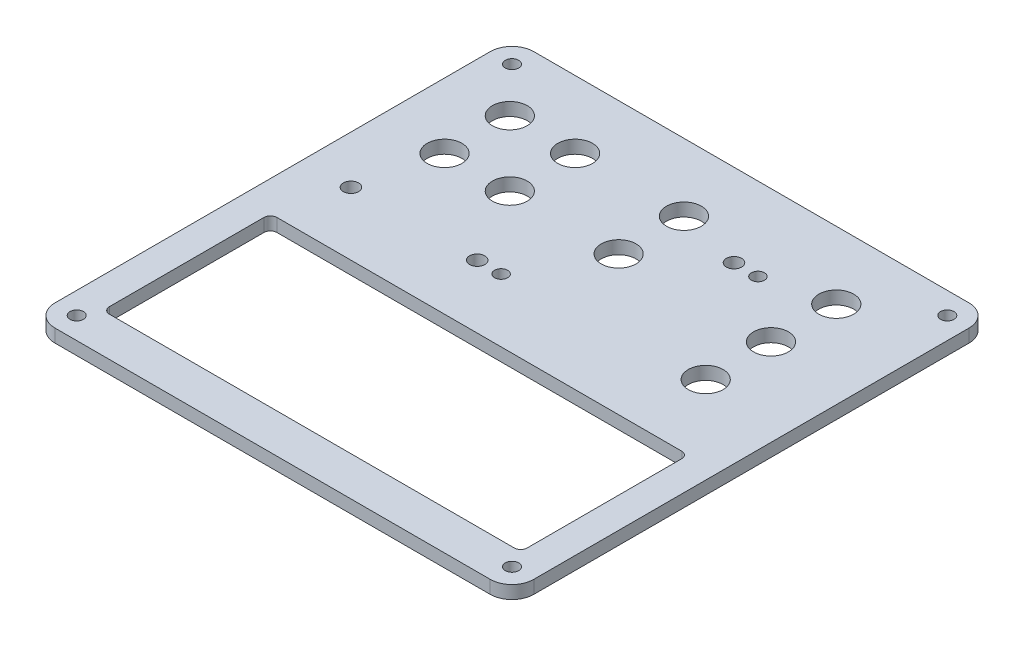
ISO-10303-21;
HEADER;
FILE_DESCRIPTION(('STEP AP214'),'2;1');
FILE_NAME('part.step','',(''),(''),'','','');
FILE_SCHEMA(('AUTOMOTIVE_DESIGN { 1 0 10303 214 1 1 1 1 }'));
ENDSEC;
DATA;
#1=APPLICATION_CONTEXT('core data for automotive mechanical design processes');
#2=APPLICATION_PROTOCOL_DEFINITION('international standard','automotive_design',2000,#1);
#3=PRODUCT_CONTEXT('',#1,'mechanical');
#4=PRODUCT('Part','Part','',(#3));
#5=PRODUCT_RELATED_PRODUCT_CATEGORY('part','',(#4));
#6=PRODUCT_DEFINITION_FORMATION('','',#4);
#7=PRODUCT_DEFINITION_CONTEXT('part definition',#1,'design');
#8=PRODUCT_DEFINITION('design','',#6,#7);
#9=PRODUCT_DEFINITION_SHAPE('','',#8);
#10=(LENGTH_UNIT() NAMED_UNIT(*) SI_UNIT(.MILLI.,.METRE.));
#11=(NAMED_UNIT(*) PLANE_ANGLE_UNIT() SI_UNIT($,.RADIAN.));
#12=(NAMED_UNIT(*) SI_UNIT($,.STERADIAN.) SOLID_ANGLE_UNIT());
#13=UNCERTAINTY_MEASURE_WITH_UNIT(LENGTH_MEASURE(1.E-05),#10,'distance_accuracy_value','');
#14=(GEOMETRIC_REPRESENTATION_CONTEXT(3) GLOBAL_UNCERTAINTY_ASSIGNED_CONTEXT((#13)) GLOBAL_UNIT_ASSIGNED_CONTEXT((#10,
#11,#12)) REPRESENTATION_CONTEXT('',''));
#15=CARTESIAN_POINT('',(0.,0.,0.));
#16=DIRECTION('',(0.,0.,1.));
#17=DIRECTION('',(1.,0.,0.));
#18=AXIS2_PLACEMENT_3D('',#15,#16,#17);
#19=CARTESIAN_POINT('',(0.,3.,0.));
#20=DIRECTION('',(0.,1.,0.));
#21=DIRECTION('',(0.,0.,1.));
#22=AXIS2_PLACEMENT_3D('',#19,#20,#21);
#23=PLANE('',#22);
#24=CARTESIAN_POINT('',(20.5,3.,-36.));
#25=DIRECTION('',(0.,1.,0.));
#26=DIRECTION('',(0.,0.,1.));
#27=AXIS2_PLACEMENT_3D('',#24,#25,#26);
#28=CIRCLE('',#27,1.5);
#29=CARTESIAN_POINT('',(20.5,3.,-34.5));
#30=VERTEX_POINT('',#29);
#31=EDGE_CURVE('E608',#30,#30,#28,.T.);
#32=ORIENTED_EDGE('',*,*,#31,.F.);
#33=EDGE_LOOP('',(#32));
#34=FACE_BOUND('',#33,.T.);
#35=CARTESIAN_POINT('',(15.,3.,-36.));
#36=DIRECTION('',(0.,1.,0.));
#37=DIRECTION('',(0.,0.,1.));
#38=AXIS2_PLACEMENT_3D('',#35,#36,#37);
#39=CIRCLE('',#38,1.75);
#40=CARTESIAN_POINT('',(15.,3.,-34.25));
#41=VERTEX_POINT('',#40);
#42=EDGE_CURVE('E602',#41,#41,#39,.T.);
#43=ORIENTED_EDGE('',*,*,#42,.F.);
#44=EDGE_LOOP('',(#43));
#45=FACE_BOUND('',#44,.T.);
#46=CARTESIAN_POINT('',(-9.50000000000002,3.,-6.99999999999999));
#47=DIRECTION('',(0.,1.,0.));
#48=DIRECTION('',(0.,0.,1.));
#49=AXIS2_PLACEMENT_3D('',#46,#47,#48);
#50=CIRCLE('',#49,1.5);
#51=CARTESIAN_POINT('',(-9.50000000000002,3.,-5.49999999999999));
#52=VERTEX_POINT('',#51);
#53=EDGE_CURVE('E593',#52,#52,#50,.T.);
#54=ORIENTED_EDGE('',*,*,#53,.F.);
#55=EDGE_LOOP('',(#54));
#56=FACE_BOUND('',#55,.T.);
#57=CARTESIAN_POINT('',(-15.,3.,-6.99999999999999));
#58=DIRECTION('',(0.,1.,0.));
#59=DIRECTION('',(0.,0.,1.));
#60=AXIS2_PLACEMENT_3D('',#57,#58,#59);
#61=CIRCLE('',#60,1.75);
#62=CARTESIAN_POINT('',(-15.,3.,-5.24999999999999));
#63=VERTEX_POINT('',#62);
#64=EDGE_CURVE('E579',#63,#63,#61,.T.);
#65=ORIENTED_EDGE('',*,*,#64,.F.);
#66=EDGE_LOOP('',(#65));
#67=FACE_BOUND('',#66,.T.);
#68=CARTESIAN_POINT('',(-44.,3.,-6.99999999999999));
#69=DIRECTION('',(0.,1.,0.));
#70=DIRECTION('',(0.,0.,1.));
#71=AXIS2_PLACEMENT_3D('',#68,#69,#70);
#72=CIRCLE('',#71,1.75);
#73=CARTESIAN_POINT('',(-44.,3.,-5.24999999999999));
#74=VERTEX_POINT('',#73);
#75=EDGE_CURVE('E574',#74,#74,#72,.T.);
#76=ORIENTED_EDGE('',*,*,#75,.F.);
#77=EDGE_LOOP('',(#76));
#78=FACE_BOUND('',#77,.T.);
#79=CARTESIAN_POINT('',(35.,3.,-9.49999999999999));
#80=DIRECTION('',(0.,1.,0.));
#81=DIRECTION('',(0.,0.,1.));
#82=AXIS2_PLACEMENT_3D('',#79,#80,#81);
#83=CIRCLE('',#82,4.00000000000001);
#84=CARTESIAN_POINT('',(35.,3.,-5.49999999999999));
#85=VERTEX_POINT('',#84);
#86=EDGE_CURVE('E568',#85,#85,#83,.T.);
#87=ORIENTED_EDGE('',*,*,#86,.F.);
#88=EDGE_LOOP('',(#87));
#89=FACE_BOUND('',#88,.T.);
#90=CARTESIAN_POINT('',(35.,3.,-24.5));
#91=DIRECTION('',(0.,1.,0.));
#92=DIRECTION('',(0.,0.,1.));
#93=AXIS2_PLACEMENT_3D('',#90,#91,#92);
#94=CIRCLE('',#93,4.00000000000001);
#95=CARTESIAN_POINT('',(35.,3.,-20.5));
#96=VERTEX_POINT('',#95);
#97=EDGE_CURVE('E551',#96,#96,#94,.T.);
#98=ORIENTED_EDGE('',*,*,#97,.F.);
#99=EDGE_LOOP('',(#98));
#100=FACE_BOUND('',#99,.T.);
#101=CARTESIAN_POINT('',(35.,3.,-39.5));
#102=DIRECTION('',(0.,1.,0.));
#103=DIRECTION('',(0.,0.,1.));
#104=AXIS2_PLACEMENT_3D('',#101,#102,#103);
#105=CIRCLE('',#104,4.00000000000001);
#106=CARTESIAN_POINT('',(35.,3.,-35.5));
#107=VERTEX_POINT('',#106);
#108=EDGE_CURVE('E543',#107,#107,#105,.T.);
#109=ORIENTED_EDGE('',*,*,#108,.F.);
#110=EDGE_LOOP('',(#109));
#111=FACE_BOUND('',#110,.T.);
#112=CARTESIAN_POINT('',(-40.,3.,-39.5));
#113=DIRECTION('',(0.,1.,0.));
#114=DIRECTION('',(0.,0.,1.));
#115=AXIS2_PLACEMENT_3D('',#112,#113,#114);
#116=CIRCLE('',#115,4.00000000000001);
#117=CARTESIAN_POINT('',(-40.,3.,-35.5));
#118=VERTEX_POINT('',#117);
#119=EDGE_CURVE('E542',#118,#118,#116,.T.);
#120=ORIENTED_EDGE('',*,*,#119,.F.);
#121=EDGE_LOOP('',(#120));
#122=FACE_BOUND('',#121,.T.);
#123=CARTESIAN_POINT('',(0.,3.,-24.5));
#124=DIRECTION('',(0.,1.,0.));
#125=DIRECTION('',(0.,0.,1.));
#126=AXIS2_PLACEMENT_3D('',#123,#124,#125);
#127=CIRCLE('',#126,4.);
#128=CARTESIAN_POINT('',(0.,3.,-20.5));
#129=VERTEX_POINT('',#128);
#130=EDGE_CURVE('E526',#129,#129,#127,.T.);
#131=ORIENTED_EDGE('',*,*,#130,.F.);
#132=EDGE_LOOP('',(#131));
#133=FACE_BOUND('',#132,.T.);
#134=CARTESIAN_POINT('',(0.,3.,-39.5));
#135=DIRECTION('',(0.,1.,0.));
#136=DIRECTION('',(0.,0.,1.));
#137=AXIS2_PLACEMENT_3D('',#134,#135,#136);
#138=CIRCLE('',#137,4.);
#139=CARTESIAN_POINT('',(0.,3.,-35.5));
#140=VERTEX_POINT('',#139);
#141=EDGE_CURVE('E520',#140,#140,#138,.T.);
#142=ORIENTED_EDGE('',*,*,#141,.F.);
#143=EDGE_LOOP('',(#142));
#144=FACE_BOUND('',#143,.T.);
#145=CARTESIAN_POINT('',(-25.,3.,-24.5));
#146=DIRECTION('',(0.,1.,0.));
#147=DIRECTION('',(0.,0.,1.));
#148=AXIS2_PLACEMENT_3D('',#145,#146,#147);
#149=CIRCLE('',#148,4.);
#150=CARTESIAN_POINT('',(-25.,3.,-20.5));
#151=VERTEX_POINT('',#150);
#152=EDGE_CURVE('E511',#151,#151,#149,.T.);
#153=ORIENTED_EDGE('',*,*,#152,.F.);
#154=EDGE_LOOP('',(#153));
#155=FACE_BOUND('',#154,.T.);
#156=CARTESIAN_POINT('',(-25.,3.,-39.5));
#157=DIRECTION('',(0.,1.,0.));
#158=DIRECTION('',(0.,0.,1.));
#159=AXIS2_PLACEMENT_3D('',#156,#157,#158);
#160=CIRCLE('',#159,4.);
#161=CARTESIAN_POINT('',(-25.,3.,-35.5));
#162=VERTEX_POINT('',#161);
#163=EDGE_CURVE('E497',#162,#162,#160,.T.);
#164=ORIENTED_EDGE('',*,*,#163,.F.);
#165=EDGE_LOOP('',(#164));
#166=FACE_BOUND('',#165,.T.);
#167=CARTESIAN_POINT('',(-40.,3.,-24.5));
#168=DIRECTION('',(0.,1.,0.));
#169=DIRECTION('',(0.,0.,1.));
#170=AXIS2_PLACEMENT_3D('',#167,#168,#169);
#171=CIRCLE('',#170,4.00000000000001);
#172=CARTESIAN_POINT('',(-40.,3.,-20.5));
#173=VERTEX_POINT('',#172);
#174=EDGE_CURVE('E492',#173,#173,#171,.T.);
#175=ORIENTED_EDGE('',*,*,#174,.F.);
#176=EDGE_LOOP('',(#175));
#177=FACE_BOUND('',#176,.T.);
#178=CARTESIAN_POINT('',(-50.,3.,-50.));
#179=DIRECTION('',(0.,1.,0.));
#180=DIRECTION('',(0.,0.,1.));
#181=AXIS2_PLACEMENT_3D('',#178,#179,#180);
#182=CIRCLE('',#181,1.55);
#183=CARTESIAN_POINT('',(-50.,3.,-48.45));
#184=VERTEX_POINT('',#183);
#185=EDGE_CURVE('E475',#184,#184,#182,.T.);
#186=ORIENTED_EDGE('',*,*,#185,.F.);
#187=EDGE_LOOP('',(#186));
#188=FACE_BOUND('',#187,.T.);
#189=CARTESIAN_POINT('',(50.,3.,50.0000000000001));
#190=DIRECTION('',(0.,1.,0.));
#191=DIRECTION('',(0.,0.,1.));
#192=AXIS2_PLACEMENT_3D('',#189,#190,#191);
#193=CIRCLE('',#192,1.55);
#194=CARTESIAN_POINT('',(50.,3.,51.5500000000001));
#195=VERTEX_POINT('',#194);
#196=EDGE_CURVE('E310',#195,#195,#193,.T.);
#197=ORIENTED_EDGE('',*,*,#196,.F.);
#198=EDGE_LOOP('',(#197));
#199=FACE_BOUND('',#198,.T.);
#200=DIRECTION('',(1.,0.,0.));
#201=VECTOR('',#200,1.);
#202=CARTESIAN_POINT('',(-55.,3.,-55.));
#203=LINE('',#202,#201);
#204=CARTESIAN_POINT('',(-50.,3.,-55.));
#205=VERTEX_POINT('',#204);
#206=CARTESIAN_POINT('',(50.,3.,-55.));
#207=VERTEX_POINT('',#206);
#208=EDGE_CURVE('E250',#205,#207,#203,.T.);
#209=ORIENTED_EDGE('',*,*,#208,.F.);
#210=CARTESIAN_POINT('',(-50.,3.,-50.));
#211=DIRECTION('',(0.,1.,0.));
#212=DIRECTION('',(0.,0.,1.));
#213=AXIS2_PLACEMENT_3D('',#210,#211,#212);
#214=CIRCLE('',#213,5.);
#215=CARTESIAN_POINT('',(-55.,3.,-50.));
#216=VERTEX_POINT('',#215);
#217=EDGE_CURVE('E298',#205,#216,#214,.T.);
#218=ORIENTED_EDGE('',*,*,#217,.T.);
#219=DIRECTION('',(0.,0.,1.));
#220=VECTOR('',#219,1.);
#221=CARTESIAN_POINT('',(-55.,3.,-55.));
#222=LINE('',#221,#220);
#223=CARTESIAN_POINT('',(-55.,3.,50.));
#224=VERTEX_POINT('',#223);
#225=EDGE_CURVE('E232',#216,#224,#222,.T.);
#226=ORIENTED_EDGE('',*,*,#225,.T.);
#227=CARTESIAN_POINT('',(-50.,3.,50.));
#228=DIRECTION('',(0.,1.,0.));
#229=DIRECTION('',(0.,0.,1.));
#230=AXIS2_PLACEMENT_3D('',#227,#228,#229);
#231=CIRCLE('',#230,5.);
#232=CARTESIAN_POINT('',(-50.,3.,55.));
#233=VERTEX_POINT('',#232);
#234=EDGE_CURVE('E266',#224,#233,#231,.T.);
#235=ORIENTED_EDGE('',*,*,#234,.T.);
#236=DIRECTION('',(1.,0.,0.));
#237=VECTOR('',#236,1.);
#238=CARTESIAN_POINT('',(-55.,3.,55.));
#239=LINE('',#238,#237);
#240=CARTESIAN_POINT('',(50.,3.,55.));
#241=VERTEX_POINT('',#240);
#242=EDGE_CURVE('E281',#233,#241,#239,.T.);
#243=ORIENTED_EDGE('',*,*,#242,.T.);
#244=CARTESIAN_POINT('',(50.,3.,50.));
#245=DIRECTION('',(0.,1.,0.));
#246=DIRECTION('',(0.,0.,1.));
#247=AXIS2_PLACEMENT_3D('',#244,#245,#246);
#248=CIRCLE('',#247,5.);
#249=CARTESIAN_POINT('',(55.,3.,50.));
#250=VERTEX_POINT('',#249);
#251=EDGE_CURVE('E270',#241,#250,#248,.T.);
#252=ORIENTED_EDGE('',*,*,#251,.T.);
#253=DIRECTION('',(0.,0.,1.));
#254=VECTOR('',#253,1.);
#255=CARTESIAN_POINT('',(55.,3.,-55.));
#256=LINE('',#255,#254);
#257=CARTESIAN_POINT('',(55.,3.,-50.));
#258=VERTEX_POINT('',#257);
#259=EDGE_CURVE('E285',#258,#250,#256,.T.);
#260=ORIENTED_EDGE('',*,*,#259,.F.);
#261=CARTESIAN_POINT('',(50.,3.,-50.));
#262=DIRECTION('',(0.,1.,0.));
#263=DIRECTION('',(0.,0.,1.));
#264=AXIS2_PLACEMENT_3D('',#261,#262,#263);
#265=CIRCLE('',#264,5.);
#266=EDGE_CURVE('E294',#258,#207,#265,.T.);
#267=ORIENTED_EDGE('',*,*,#266,.T.);
#268=EDGE_LOOP('',(#209,#218,#226,#235,#243,#252,#260,#267));
#269=FACE_BOUND('',#268,.T.);
#270=CARTESIAN_POINT('',(-50.,3.,50.));
#271=DIRECTION('',(0.,1.,0.));
#272=DIRECTION('',(0.,0.,1.));
#273=AXIS2_PLACEMENT_3D('',#270,#271,#272);
#274=CIRCLE('',#273,1.55);
#275=CARTESIAN_POINT('',(-50.,3.,51.55));
#276=VERTEX_POINT('',#275);
#277=EDGE_CURVE('E240',#276,#276,#274,.T.);
#278=ORIENTED_EDGE('',*,*,#277,.F.);
#279=EDGE_LOOP('',(#278));
#280=FACE_BOUND('',#279,.T.);
#281=CARTESIAN_POINT('',(50.,3.,-50.));
#282=DIRECTION('',(0.,1.,0.));
#283=DIRECTION('',(0.,0.,1.));
#284=AXIS2_PLACEMENT_3D('',#281,#282,#283);
#285=CIRCLE('',#284,1.55);
#286=CARTESIAN_POINT('',(50.,3.,-48.45));
#287=VERTEX_POINT('',#286);
#288=EDGE_CURVE('E320',#287,#287,#285,.T.);
#289=ORIENTED_EDGE('',*,*,#288,.F.);
#290=EDGE_LOOP('',(#289));
#291=FACE_BOUND('',#290,.T.);
#292=DIRECTION('',(1.,0.,0.));
#293=VECTOR('',#292,1.);
#294=CARTESIAN_POINT('',(-48.,3.,46.));
#295=LINE('',#294,#293);
#296=CARTESIAN_POINT('',(-46.5,3.,46.));
#297=VERTEX_POINT('',#296);
#298=CARTESIAN_POINT('',(46.5,3.,46.));
#299=VERTEX_POINT('',#298);
#300=EDGE_CURVE('E454',#297,#299,#295,.T.);
#301=ORIENTED_EDGE('',*,*,#300,.F.);
#302=CARTESIAN_POINT('',(-46.5,3.,44.5));
#303=DIRECTION('',(0.,1.,0.));
#304=DIRECTION('',(0.,0.,1.));
#305=AXIS2_PLACEMENT_3D('',#302,#303,#304);
#306=CIRCLE('',#305,1.5);
#307=CARTESIAN_POINT('',(-48.,3.,44.5));
#308=VERTEX_POINT('',#307);
#309=EDGE_CURVE('E412',#297,#308,#306,.F.);
#310=ORIENTED_EDGE('',*,*,#309,.T.);
#311=DIRECTION('',(0.,0.,-1.));
#312=VECTOR('',#311,1.);
#313=CARTESIAN_POINT('',(-48.,3.,46.));
#314=LINE('',#313,#312);
#315=CARTESIAN_POINT('',(-48.,3.,9.00000000000001));
#316=VERTEX_POINT('',#315);
#317=EDGE_CURVE('E460',#308,#316,#314,.T.);
#318=ORIENTED_EDGE('',*,*,#317,.T.);
#319=CARTESIAN_POINT('',(-46.5,3.,9.00000000000001));
#320=DIRECTION('',(0.,1.,0.));
#321=DIRECTION('',(0.,0.,1.));
#322=AXIS2_PLACEMENT_3D('',#319,#320,#321);
#323=CIRCLE('',#322,1.5);
#324=CARTESIAN_POINT('',(-46.5,3.,7.50000000000001));
#325=VERTEX_POINT('',#324);
#326=EDGE_CURVE('E106',#316,#325,#323,.F.);
#327=ORIENTED_EDGE('',*,*,#326,.T.);
#328=DIRECTION('',(1.,0.,0.));
#329=VECTOR('',#328,1.);
#330=CARTESIAN_POINT('',(-48.,3.,7.50000000000001));
#331=LINE('',#330,#329);
#332=CARTESIAN_POINT('',(46.5,3.,7.50000000000001));
#333=VERTEX_POINT('',#332);
#334=EDGE_CURVE('E462',#325,#333,#331,.T.);
#335=ORIENTED_EDGE('',*,*,#334,.T.);
#336=CARTESIAN_POINT('',(46.5,3.,9.00000000000001));
#337=DIRECTION('',(0.,1.,0.));
#338=DIRECTION('',(0.,0.,1.));
#339=AXIS2_PLACEMENT_3D('',#336,#337,#338);
#340=CIRCLE('',#339,1.5);
#341=CARTESIAN_POINT('',(48.,3.,9.00000000000001));
#342=VERTEX_POINT('',#341);
#343=EDGE_CURVE('E399',#333,#342,#340,.F.);
#344=ORIENTED_EDGE('',*,*,#343,.T.);
#345=DIRECTION('',(0.,0.,-1.));
#346=VECTOR('',#345,1.);
#347=CARTESIAN_POINT('',(48.,3.,46.));
#348=LINE('',#347,#346);
#349=CARTESIAN_POINT('',(48.,3.,44.5));
#350=VERTEX_POINT('',#349);
#351=EDGE_CURVE('E457',#350,#342,#348,.T.);
#352=ORIENTED_EDGE('',*,*,#351,.F.);
#353=CARTESIAN_POINT('',(46.5,3.,44.5));
#354=DIRECTION('',(0.,1.,0.));
#355=DIRECTION('',(0.,0.,1.));
#356=AXIS2_PLACEMENT_3D('',#353,#354,#355);
#357=CIRCLE('',#356,1.5);
#358=EDGE_CURVE('E407',#350,#299,#357,.F.);
#359=ORIENTED_EDGE('',*,*,#358,.T.);
#360=EDGE_LOOP('',(#301,#310,#318,#327,#335,#344,#352,#359));
#361=FACE_BOUND('',#360,.T.);
#362=ADVANCED_FACE('F98',(#34,#45,#56,#67,#78,#89,#100,#111,#122,#133,#144,#155,#166,#177,#188,
#199,#269,#280,#291,#361),#23,.T.);
#363=CARTESIAN_POINT('',(0.,0.,0.));
#364=DIRECTION('',(0.,1.,0.));
#365=DIRECTION('',(0.,0.,1.));
#366=AXIS2_PLACEMENT_3D('',#363,#364,#365);
#367=PLANE('',#366);
#368=CARTESIAN_POINT('',(20.5,0.,-36.));
#369=DIRECTION('',(0.,1.,0.));
#370=DIRECTION('',(0.,0.,1.));
#371=AXIS2_PLACEMENT_3D('',#368,#369,#370);
#372=CIRCLE('',#371,1.5);
#373=CARTESIAN_POINT('',(20.5,0.,-34.5));
#374=VERTEX_POINT('',#373);
#375=EDGE_CURVE('E612',#374,#374,#372,.T.);
#376=ORIENTED_EDGE('',*,*,#375,.T.);
#377=EDGE_LOOP('',(#376));
#378=FACE_BOUND('',#377,.T.);
#379=CARTESIAN_POINT('',(15.,0.,-36.));
#380=DIRECTION('',(0.,1.,0.));
#381=DIRECTION('',(0.,0.,1.));
#382=AXIS2_PLACEMENT_3D('',#379,#380,#381);
#383=CIRCLE('',#382,1.75);
#384=CARTESIAN_POINT('',(15.,0.,-34.25));
#385=VERTEX_POINT('',#384);
#386=EDGE_CURVE('E605',#385,#385,#383,.T.);
#387=ORIENTED_EDGE('',*,*,#386,.T.);
#388=EDGE_LOOP('',(#387));
#389=FACE_BOUND('',#388,.T.);
#390=CARTESIAN_POINT('',(-9.50000000000002,0.,-6.99999999999999));
#391=DIRECTION('',(0.,1.,0.));
#392=DIRECTION('',(0.,0.,1.));
#393=AXIS2_PLACEMENT_3D('',#390,#391,#392);
#394=CIRCLE('',#393,1.5);
#395=CARTESIAN_POINT('',(-9.50000000000002,0.,-5.49999999999999));
#396=VERTEX_POINT('',#395);
#397=EDGE_CURVE('E591',#396,#396,#394,.T.);
#398=ORIENTED_EDGE('',*,*,#397,.T.);
#399=EDGE_LOOP('',(#398));
#400=FACE_BOUND('',#399,.T.);
#401=CARTESIAN_POINT('',(-15.,0.,-6.99999999999999));
#402=DIRECTION('',(0.,1.,0.));
#403=DIRECTION('',(0.,0.,1.));
#404=AXIS2_PLACEMENT_3D('',#401,#402,#403);
#405=CIRCLE('',#404,1.75);
#406=CARTESIAN_POINT('',(-15.,0.,-5.24999999999999));
#407=VERTEX_POINT('',#406);
#408=EDGE_CURVE('E590',#407,#407,#405,.T.);
#409=ORIENTED_EDGE('',*,*,#408,.T.);
#410=EDGE_LOOP('',(#409));
#411=FACE_BOUND('',#410,.T.);
#412=CARTESIAN_POINT('',(-44.,0.,-6.99999999999999));
#413=DIRECTION('',(0.,1.,0.));
#414=DIRECTION('',(0.,0.,1.));
#415=AXIS2_PLACEMENT_3D('',#412,#413,#414);
#416=CIRCLE('',#415,1.75);
#417=CARTESIAN_POINT('',(-44.,0.,-5.24999999999999));
#418=VERTEX_POINT('',#417);
#419=EDGE_CURVE('E569',#418,#418,#416,.T.);
#420=ORIENTED_EDGE('',*,*,#419,.T.);
#421=EDGE_LOOP('',(#420));
#422=FACE_BOUND('',#421,.T.);
#423=CARTESIAN_POINT('',(35.,0.,-9.49999999999999));
#424=DIRECTION('',(0.,1.,0.));
#425=DIRECTION('',(0.,0.,1.));
#426=AXIS2_PLACEMENT_3D('',#423,#424,#425);
#427=CIRCLE('',#426,4.00000000000001);
#428=CARTESIAN_POINT('',(35.,0.,-5.49999999999999));
#429=VERTEX_POINT('',#428);
#430=EDGE_CURVE('E566',#429,#429,#427,.T.);
#431=ORIENTED_EDGE('',*,*,#430,.T.);
#432=EDGE_LOOP('',(#431));
#433=FACE_BOUND('',#432,.T.);
#434=CARTESIAN_POINT('',(35.,0.,-24.5));
#435=DIRECTION('',(0.,1.,0.));
#436=DIRECTION('',(0.,0.,1.));
#437=AXIS2_PLACEMENT_3D('',#434,#435,#436);
#438=CIRCLE('',#437,4.00000000000001);
#439=CARTESIAN_POINT('',(35.,0.,-20.5));
#440=VERTEX_POINT('',#439);
#441=EDGE_CURVE('E556',#440,#440,#438,.T.);
#442=ORIENTED_EDGE('',*,*,#441,.T.);
#443=EDGE_LOOP('',(#442));
#444=FACE_BOUND('',#443,.T.);
#445=CARTESIAN_POINT('',(35.,0.,-39.5));
#446=DIRECTION('',(0.,1.,0.));
#447=DIRECTION('',(0.,0.,1.));
#448=AXIS2_PLACEMENT_3D('',#445,#446,#447);
#449=CIRCLE('',#448,4.00000000000001);
#450=CARTESIAN_POINT('',(35.,0.,-35.5));
#451=VERTEX_POINT('',#450);
#452=EDGE_CURVE('E548',#451,#451,#449,.T.);
#453=ORIENTED_EDGE('',*,*,#452,.T.);
#454=EDGE_LOOP('',(#453));
#455=FACE_BOUND('',#454,.T.);
#456=CARTESIAN_POINT('',(-40.,0.,-39.5));
#457=DIRECTION('',(0.,1.,0.));
#458=DIRECTION('',(0.,0.,1.));
#459=AXIS2_PLACEMENT_3D('',#456,#457,#458);
#460=CIRCLE('',#459,4.00000000000001);
#461=CARTESIAN_POINT('',(-40.,0.,-35.5));
#462=VERTEX_POINT('',#461);
#463=EDGE_CURVE('E540',#462,#462,#460,.T.);
#464=ORIENTED_EDGE('',*,*,#463,.T.);
#465=EDGE_LOOP('',(#464));
#466=FACE_BOUND('',#465,.T.);
#467=CARTESIAN_POINT('',(0.,0.,-24.5));
#468=DIRECTION('',(0.,1.,0.));
#469=DIRECTION('',(0.,0.,1.));
#470=AXIS2_PLACEMENT_3D('',#467,#468,#469);
#471=CIRCLE('',#470,4.);
#472=CARTESIAN_POINT('',(0.,0.,-20.5));
#473=VERTEX_POINT('',#472);
#474=EDGE_CURVE('E530',#473,#473,#471,.T.);
#475=ORIENTED_EDGE('',*,*,#474,.T.);
#476=EDGE_LOOP('',(#475));
#477=FACE_BOUND('',#476,.T.);
#478=CARTESIAN_POINT('',(0.,0.,-39.5));
#479=DIRECTION('',(0.,1.,0.));
#480=DIRECTION('',(0.,0.,1.));
#481=AXIS2_PLACEMENT_3D('',#478,#479,#480);
#482=CIRCLE('',#481,4.);
#483=CARTESIAN_POINT('',(0.,0.,-35.5));
#484=VERTEX_POINT('',#483);
#485=EDGE_CURVE('E523',#484,#484,#482,.T.);
#486=ORIENTED_EDGE('',*,*,#485,.T.);
#487=EDGE_LOOP('',(#486));
#488=FACE_BOUND('',#487,.T.);
#489=CARTESIAN_POINT('',(-25.,0.,-24.5));
#490=DIRECTION('',(0.,1.,0.));
#491=DIRECTION('',(0.,0.,1.));
#492=AXIS2_PLACEMENT_3D('',#489,#490,#491);
#493=CIRCLE('',#492,4.);
#494=CARTESIAN_POINT('',(-25.,0.,-20.5));
#495=VERTEX_POINT('',#494);
#496=EDGE_CURVE('E509',#495,#495,#493,.T.);
#497=ORIENTED_EDGE('',*,*,#496,.T.);
#498=EDGE_LOOP('',(#497));
#499=FACE_BOUND('',#498,.T.);
#500=CARTESIAN_POINT('',(-25.,0.,-39.5));
#501=DIRECTION('',(0.,1.,0.));
#502=DIRECTION('',(0.,0.,1.));
#503=AXIS2_PLACEMENT_3D('',#500,#501,#502);
#504=CIRCLE('',#503,4.);
#505=CARTESIAN_POINT('',(-25.,0.,-35.5));
#506=VERTEX_POINT('',#505);
#507=EDGE_CURVE('E508',#506,#506,#504,.T.);
#508=ORIENTED_EDGE('',*,*,#507,.T.);
#509=EDGE_LOOP('',(#508));
#510=FACE_BOUND('',#509,.T.);
#511=CARTESIAN_POINT('',(-40.,0.,-24.5));
#512=DIRECTION('',(0.,1.,0.));
#513=DIRECTION('',(0.,0.,1.));
#514=AXIS2_PLACEMENT_3D('',#511,#512,#513);
#515=CIRCLE('',#514,4.00000000000001);
#516=CARTESIAN_POINT('',(-40.,0.,-20.5));
#517=VERTEX_POINT('',#516);
#518=EDGE_CURVE('E463',#517,#517,#515,.T.);
#519=ORIENTED_EDGE('',*,*,#518,.T.);
#520=EDGE_LOOP('',(#519));
#521=FACE_BOUND('',#520,.T.);
#522=CARTESIAN_POINT('',(-50.,0.,-50.));
#523=DIRECTION('',(0.,1.,0.));
#524=DIRECTION('',(0.,0.,1.));
#525=AXIS2_PLACEMENT_3D('',#522,#523,#524);
#526=CIRCLE('',#525,1.55);
#527=CARTESIAN_POINT('',(-50.,0.,-48.45));
#528=VERTEX_POINT('',#527);
#529=EDGE_CURVE('E485',#528,#528,#526,.T.);
#530=ORIENTED_EDGE('',*,*,#529,.T.);
#531=EDGE_LOOP('',(#530));
#532=FACE_BOUND('',#531,.T.);
#533=CARTESIAN_POINT('',(50.,0.,50.0000000000001));
#534=DIRECTION('',(0.,1.,0.));
#535=DIRECTION('',(0.,0.,1.));
#536=AXIS2_PLACEMENT_3D('',#533,#534,#535);
#537=CIRCLE('',#536,1.55);
#538=CARTESIAN_POINT('',(50.,0.,51.5500000000001));
#539=VERTEX_POINT('',#538);
#540=EDGE_CURVE('E316',#539,#539,#537,.T.);
#541=ORIENTED_EDGE('',*,*,#540,.T.);
#542=EDGE_LOOP('',(#541));
#543=FACE_BOUND('',#542,.T.);
#544=DIRECTION('',(0.,0.,1.));
#545=VECTOR('',#544,1.);
#546=CARTESIAN_POINT('',(-55.,0.,-55.));
#547=LINE('',#546,#545);
#548=CARTESIAN_POINT('',(-55.,0.,-50.));
#549=VERTEX_POINT('',#548);
#550=CARTESIAN_POINT('',(-55.,0.,50.));
#551=VERTEX_POINT('',#550);
#552=EDGE_CURVE('E229',#549,#551,#547,.T.);
#553=ORIENTED_EDGE('',*,*,#552,.F.);
#554=CARTESIAN_POINT('',(-50.,0.,-50.));
#555=DIRECTION('',(0.,1.,0.));
#556=DIRECTION('',(0.,0.,1.));
#557=AXIS2_PLACEMENT_3D('',#554,#555,#556);
#558=CIRCLE('',#557,5.);
#559=CARTESIAN_POINT('',(-50.,0.,-55.));
#560=VERTEX_POINT('',#559);
#561=EDGE_CURVE('E212',#549,#560,#558,.F.);
#562=ORIENTED_EDGE('',*,*,#561,.T.);
#563=DIRECTION('',(1.,0.,0.));
#564=VECTOR('',#563,1.);
#565=CARTESIAN_POINT('',(-55.,0.,-55.));
#566=LINE('',#565,#564);
#567=CARTESIAN_POINT('',(50.,0.,-55.));
#568=VERTEX_POINT('',#567);
#569=EDGE_CURVE('E256',#560,#568,#566,.T.);
#570=ORIENTED_EDGE('',*,*,#569,.T.);
#571=CARTESIAN_POINT('',(50.,0.,-50.));
#572=DIRECTION('',(0.,1.,0.));
#573=DIRECTION('',(0.,0.,1.));
#574=AXIS2_PLACEMENT_3D('',#571,#572,#573);
#575=CIRCLE('',#574,5.);
#576=CARTESIAN_POINT('',(55.,0.,-50.));
#577=VERTEX_POINT('',#576);
#578=EDGE_CURVE('E223',#568,#577,#575,.F.);
#579=ORIENTED_EDGE('',*,*,#578,.T.);
#580=DIRECTION('',(0.,0.,1.));
#581=VECTOR('',#580,1.);
#582=CARTESIAN_POINT('',(55.,0.,-55.));
#583=LINE('',#582,#581);
#584=CARTESIAN_POINT('',(55.,0.,50.));
#585=VERTEX_POINT('',#584);
#586=EDGE_CURVE('E243',#577,#585,#583,.T.);
#587=ORIENTED_EDGE('',*,*,#586,.T.);
#588=CARTESIAN_POINT('',(50.,0.,50.));
#589=DIRECTION('',(0.,1.,0.));
#590=DIRECTION('',(0.,0.,1.));
#591=AXIS2_PLACEMENT_3D('',#588,#589,#590);
#592=CIRCLE('',#591,5.);
#593=CARTESIAN_POINT('',(50.,0.,55.));
#594=VERTEX_POINT('',#593);
#595=EDGE_CURVE('E260',#585,#594,#592,.F.);
#596=ORIENTED_EDGE('',*,*,#595,.T.);
#597=DIRECTION('',(1.,0.,0.));
#598=VECTOR('',#597,1.);
#599=CARTESIAN_POINT('',(-55.,0.,55.));
#600=LINE('',#599,#598);
#601=CARTESIAN_POINT('',(-50.,0.,55.));
#602=VERTEX_POINT('',#601);
#603=EDGE_CURVE('E239',#602,#594,#600,.T.);
#604=ORIENTED_EDGE('',*,*,#603,.F.);
#605=CARTESIAN_POINT('',(-50.,0.,50.));
#606=DIRECTION('',(0.,1.,0.));
#607=DIRECTION('',(0.,0.,1.));
#608=AXIS2_PLACEMENT_3D('',#605,#606,#607);
#609=CIRCLE('',#608,5.);
#610=EDGE_CURVE('E233',#602,#551,#609,.F.);
#611=ORIENTED_EDGE('',*,*,#610,.T.);
#612=EDGE_LOOP('',(#553,#562,#570,#579,#587,#596,#604,#611));
#613=FACE_BOUND('',#612,.T.);
#614=CARTESIAN_POINT('',(-50.,0.,50.));
#615=DIRECTION('',(0.,1.,0.));
#616=DIRECTION('',(0.,0.,1.));
#617=AXIS2_PLACEMENT_3D('',#614,#615,#616);
#618=CIRCLE('',#617,1.55);
#619=CARTESIAN_POINT('',(-50.,0.,51.55));
#620=VERTEX_POINT('',#619);
#621=EDGE_CURVE('E247',#620,#620,#618,.T.);
#622=ORIENTED_EDGE('',*,*,#621,.T.);
#623=EDGE_LOOP('',(#622));
#624=FACE_BOUND('',#623,.T.);
#625=CARTESIAN_POINT('',(50.,0.,-50.));
#626=DIRECTION('',(0.,1.,0.));
#627=DIRECTION('',(0.,0.,1.));
#628=AXIS2_PLACEMENT_3D('',#625,#626,#627);
#629=CIRCLE('',#628,1.55);
#630=CARTESIAN_POINT('',(50.,0.,-48.45));
#631=VERTEX_POINT('',#630);
#632=EDGE_CURVE('E317',#631,#631,#629,.T.);
#633=ORIENTED_EDGE('',*,*,#632,.T.);
#634=EDGE_LOOP('',(#633));
#635=FACE_BOUND('',#634,.T.);
#636=DIRECTION('',(0.,0.,-1.));
#637=VECTOR('',#636,1.);
#638=CARTESIAN_POINT('',(-48.,0.,46.));
#639=LINE('',#638,#637);
#640=CARTESIAN_POINT('',(-48.,0.,44.5));
#641=VERTEX_POINT('',#640);
#642=CARTESIAN_POINT('',(-48.,0.,9.00000000000001));
#643=VERTEX_POINT('',#642);
#644=EDGE_CURVE('E456',#641,#643,#639,.T.);
#645=ORIENTED_EDGE('',*,*,#644,.F.);
#646=CARTESIAN_POINT('',(-46.5,0.,44.5));
#647=DIRECTION('',(0.,1.,0.));
#648=DIRECTION('',(0.,0.,1.));
#649=AXIS2_PLACEMENT_3D('',#646,#647,#648);
#650=CIRCLE('',#649,1.5);
#651=CARTESIAN_POINT('',(-46.5,0.,46.));
#652=VERTEX_POINT('',#651);
#653=EDGE_CURVE('E410',#641,#652,#650,.T.);
#654=ORIENTED_EDGE('',*,*,#653,.T.);
#655=DIRECTION('',(1.,0.,0.));
#656=VECTOR('',#655,1.);
#657=CARTESIAN_POINT('',(-48.,0.,46.));
#658=LINE('',#657,#656);
#659=CARTESIAN_POINT('',(46.5,0.,46.));
#660=VERTEX_POINT('',#659);
#661=EDGE_CURVE('E482',#652,#660,#658,.T.);
#662=ORIENTED_EDGE('',*,*,#661,.T.);
#663=CARTESIAN_POINT('',(46.5,0.,44.5));
#664=DIRECTION('',(0.,1.,0.));
#665=DIRECTION('',(0.,0.,1.));
#666=AXIS2_PLACEMENT_3D('',#663,#664,#665);
#667=CIRCLE('',#666,1.5);
#668=CARTESIAN_POINT('',(48.,0.,44.5));
#669=VERTEX_POINT('',#668);
#670=EDGE_CURVE('E403',#660,#669,#667,.T.);
#671=ORIENTED_EDGE('',*,*,#670,.T.);
#672=DIRECTION('',(0.,0.,-1.));
#673=VECTOR('',#672,1.);
#674=CARTESIAN_POINT('',(48.,0.,46.));
#675=LINE('',#674,#673);
#676=CARTESIAN_POINT('',(48.,0.,9.00000000000001));
#677=VERTEX_POINT('',#676);
#678=EDGE_CURVE('E486',#669,#677,#675,.T.);
#679=ORIENTED_EDGE('',*,*,#678,.T.);
#680=CARTESIAN_POINT('',(46.5,0.,9.00000000000001));
#681=DIRECTION('',(0.,1.,0.));
#682=DIRECTION('',(0.,0.,1.));
#683=AXIS2_PLACEMENT_3D('',#680,#681,#682);
#684=CIRCLE('',#683,1.5);
#685=CARTESIAN_POINT('',(46.5,0.,7.50000000000001));
#686=VERTEX_POINT('',#685);
#687=EDGE_CURVE('E113',#677,#686,#684,.T.);
#688=ORIENTED_EDGE('',*,*,#687,.T.);
#689=DIRECTION('',(1.,0.,0.));
#690=VECTOR('',#689,1.);
#691=CARTESIAN_POINT('',(-48.,0.,7.50000000000001));
#692=LINE('',#691,#690);
#693=CARTESIAN_POINT('',(-46.5,0.,7.50000000000001));
#694=VERTEX_POINT('',#693);
#695=EDGE_CURVE('E488',#694,#686,#692,.T.);
#696=ORIENTED_EDGE('',*,*,#695,.F.);
#697=CARTESIAN_POINT('',(-46.5,0.,9.00000000000001));
#698=DIRECTION('',(0.,1.,0.));
#699=DIRECTION('',(0.,0.,1.));
#700=AXIS2_PLACEMENT_3D('',#697,#698,#699);
#701=CIRCLE('',#700,1.5);
#702=EDGE_CURVE('E13',#694,#643,#701,.T.);
#703=ORIENTED_EDGE('',*,*,#702,.T.);
#704=EDGE_LOOP('',(#645,#654,#662,#671,#679,#688,#696,#703));
#705=FACE_BOUND('',#704,.T.);
#706=ADVANCED_FACE('F236',(#378,#389,#400,#411,#422,#433,#444,#455,#466,#477,#488,#499,#510,
#521,#532,#543,#613,#624,#635,#705),#367,.F.);
#707=CARTESIAN_POINT('',(-55.,3.,-55.));
#708=DIRECTION('',(1.,0.,0.));
#709=DIRECTION('',(0.,0.,-1.));
#710=AXIS2_PLACEMENT_3D('',#707,#708,#709);
#711=PLANE('',#710);
#712=ORIENTED_EDGE('',*,*,#225,.F.);
#713=DIRECTION('',(0.,-1.,0.));
#714=VECTOR('',#713,1.);
#715=CARTESIAN_POINT('',(-55.,0.,-50.));
#716=LINE('',#715,#714);
#717=EDGE_CURVE('E216',#216,#549,#716,.T.);
#718=ORIENTED_EDGE('',*,*,#717,.T.);
#719=ORIENTED_EDGE('',*,*,#552,.T.);
#720=DIRECTION('',(0.,-1.,0.));
#721=VECTOR('',#720,1.);
#722=CARTESIAN_POINT('',(-55.,3.,50.));
#723=LINE('',#722,#721);
#724=EDGE_CURVE('E234',#551,#224,#723,.F.);
#725=ORIENTED_EDGE('',*,*,#724,.T.);
#726=EDGE_LOOP('',(#712,#718,#719,#725));
#727=FACE_BOUND('',#726,.T.);
#728=ADVANCED_FACE('F228',(#727),#711,.F.);
#729=CARTESIAN_POINT('',(-55.,3.,55.));
#730=DIRECTION('',(0.,0.,-1.));
#731=DIRECTION('',(-1.,0.,0.));
#732=AXIS2_PLACEMENT_3D('',#729,#730,#731);
#733=PLANE('',#732);
#734=ORIENTED_EDGE('',*,*,#603,.T.);
#735=DIRECTION('',(0.,-1.,0.));
#736=VECTOR('',#735,1.);
#737=CARTESIAN_POINT('',(50.,3.,55.));
#738=LINE('',#737,#736);
#739=EDGE_CURVE('E431',#594,#241,#738,.F.);
#740=ORIENTED_EDGE('',*,*,#739,.T.);
#741=ORIENTED_EDGE('',*,*,#242,.F.);
#742=DIRECTION('',(0.,-1.,0.));
#743=VECTOR('',#742,1.);
#744=CARTESIAN_POINT('',(-50.,3.,55.));
#745=LINE('',#744,#743);
#746=EDGE_CURVE('E433',#233,#602,#745,.T.);
#747=ORIENTED_EDGE('',*,*,#746,.T.);
#748=EDGE_LOOP('',(#734,#740,#741,#747));
#749=FACE_BOUND('',#748,.T.);
#750=ADVANCED_FACE('F355',(#749),#733,.F.);
#751=CARTESIAN_POINT('',(55.,3.,-55.));
#752=DIRECTION('',(1.,0.,0.));
#753=DIRECTION('',(0.,0.,-1.));
#754=AXIS2_PLACEMENT_3D('',#751,#752,#753);
#755=PLANE('',#754);
#756=ORIENTED_EDGE('',*,*,#586,.F.);
#757=DIRECTION('',(0.,-1.,0.));
#758=VECTOR('',#757,1.);
#759=CARTESIAN_POINT('',(55.,3.,-50.));
#760=LINE('',#759,#758);
#761=EDGE_CURVE('E435',#577,#258,#760,.F.);
#762=ORIENTED_EDGE('',*,*,#761,.T.);
#763=ORIENTED_EDGE('',*,*,#259,.T.);
#764=DIRECTION('',(0.,-1.,0.));
#765=VECTOR('',#764,1.);
#766=CARTESIAN_POINT('',(55.,0.,50.));
#767=LINE('',#766,#765);
#768=EDGE_CURVE('E302',#250,#585,#767,.T.);
#769=ORIENTED_EDGE('',*,*,#768,.T.);
#770=EDGE_LOOP('',(#756,#762,#763,#769));
#771=FACE_BOUND('',#770,.T.);
#772=ADVANCED_FACE('F339',(#771),#755,.T.);
#773=CARTESIAN_POINT('',(-55.,3.,-55.));
#774=DIRECTION('',(0.,0.,-1.));
#775=DIRECTION('',(-1.,0.,0.));
#776=AXIS2_PLACEMENT_3D('',#773,#774,#775);
#777=PLANE('',#776);
#778=ORIENTED_EDGE('',*,*,#569,.F.);
#779=DIRECTION('',(0.,-1.,0.));
#780=VECTOR('',#779,1.);
#781=CARTESIAN_POINT('',(-50.,3.,-55.));
#782=LINE('',#781,#780);
#783=EDGE_CURVE('E217',#560,#205,#782,.F.);
#784=ORIENTED_EDGE('',*,*,#783,.T.);
#785=ORIENTED_EDGE('',*,*,#208,.T.);
#786=DIRECTION('',(0.,-1.,0.));
#787=VECTOR('',#786,1.);
#788=CARTESIAN_POINT('',(50.,3.,-55.));
#789=LINE('',#788,#787);
#790=EDGE_CURVE('E222',#207,#568,#789,.T.);
#791=ORIENTED_EDGE('',*,*,#790,.T.);
#792=EDGE_LOOP('',(#778,#784,#785,#791));
#793=FACE_BOUND('',#792,.T.);
#794=ADVANCED_FACE('F329',(#793),#777,.T.);
#795=CARTESIAN_POINT('',(-50.,3.,50.));
#796=DIRECTION('',(0.,-1.,0.));
#797=DIRECTION('',(0.,0.,-1.));
#798=AXIS2_PLACEMENT_3D('',#795,#796,#797);
#799=CYLINDRICAL_SURFACE('',#798,1.55);
#800=ORIENTED_EDGE('',*,*,#277,.T.);
#801=EDGE_LOOP('',(#800));
#802=FACE_BOUND('',#801,.T.);
#803=ORIENTED_EDGE('',*,*,#621,.F.);
#804=EDGE_LOOP('',(#803));
#805=FACE_BOUND('',#804,.T.);
#806=ADVANCED_FACE('F326',(#802,#805),#799,.F.);
#807=CARTESIAN_POINT('',(50.,3.,50.0000000000001));
#808=DIRECTION('',(0.,-1.,0.));
#809=DIRECTION('',(0.,0.,-1.));
#810=AXIS2_PLACEMENT_3D('',#807,#808,#809);
#811=CYLINDRICAL_SURFACE('',#810,1.55);
#812=ORIENTED_EDGE('',*,*,#196,.T.);
#813=EDGE_LOOP('',(#812));
#814=FACE_BOUND('',#813,.T.);
#815=ORIENTED_EDGE('',*,*,#540,.F.);
#816=EDGE_LOOP('',(#815));
#817=FACE_BOUND('',#816,.T.);
#818=ADVANCED_FACE('F328',(#814,#817),#811,.F.);
#819=CARTESIAN_POINT('',(50.,3.,-50.));
#820=DIRECTION('',(0.,-1.,0.));
#821=DIRECTION('',(0.,0.,-1.));
#822=AXIS2_PLACEMENT_3D('',#819,#820,#821);
#823=CYLINDRICAL_SURFACE('',#822,1.55);
#824=ORIENTED_EDGE('',*,*,#288,.T.);
#825=EDGE_LOOP('',(#824));
#826=FACE_BOUND('',#825,.T.);
#827=ORIENTED_EDGE('',*,*,#632,.F.);
#828=EDGE_LOOP('',(#827));
#829=FACE_BOUND('',#828,.T.);
#830=ADVANCED_FACE('F336',(#826,#829),#823,.F.);
#831=CARTESIAN_POINT('',(-50.,3.,-50.));
#832=DIRECTION('',(0.,-1.,0.));
#833=DIRECTION('',(0.,0.,-1.));
#834=AXIS2_PLACEMENT_3D('',#831,#832,#833);
#835=CYLINDRICAL_SURFACE('',#834,1.55);
#836=ORIENTED_EDGE('',*,*,#185,.T.);
#837=EDGE_LOOP('',(#836));
#838=FACE_BOUND('',#837,.T.);
#839=ORIENTED_EDGE('',*,*,#529,.F.);
#840=EDGE_LOOP('',(#839));
#841=FACE_BOUND('',#840,.T.);
#842=ADVANCED_FACE('F365',(#838,#841),#835,.F.);
#843=CARTESIAN_POINT('',(-50.,3.,-50.));
#844=DIRECTION('',(0.,1.,0.));
#845=DIRECTION('',(0.,0.,1.));
#846=AXIS2_PLACEMENT_3D('',#843,#844,#845);
#847=CYLINDRICAL_SURFACE('',#846,5.);
#848=ORIENTED_EDGE('',*,*,#217,.F.);
#849=ORIENTED_EDGE('',*,*,#783,.F.);
#850=ORIENTED_EDGE('',*,*,#561,.F.);
#851=ORIENTED_EDGE('',*,*,#717,.F.);
#852=EDGE_LOOP('',(#848,#849,#850,#851));
#853=FACE_BOUND('',#852,.T.);
#854=ADVANCED_FACE('F215',(#853),#847,.T.);
#855=CARTESIAN_POINT('',(50.,3.,-50.));
#856=DIRECTION('',(0.,-1.,0.));
#857=DIRECTION('',(0.,0.,-1.));
#858=AXIS2_PLACEMENT_3D('',#855,#856,#857);
#859=CYLINDRICAL_SURFACE('',#858,5.);
#860=ORIENTED_EDGE('',*,*,#266,.F.);
#861=ORIENTED_EDGE('',*,*,#761,.F.);
#862=ORIENTED_EDGE('',*,*,#578,.F.);
#863=ORIENTED_EDGE('',*,*,#790,.F.);
#864=EDGE_LOOP('',(#860,#861,#862,#863));
#865=FACE_BOUND('',#864,.T.);
#866=ADVANCED_FACE('F364',(#865),#859,.T.);
#867=CARTESIAN_POINT('',(50.,3.,50.));
#868=DIRECTION('',(0.,1.,0.));
#869=DIRECTION('',(0.,0.,1.));
#870=AXIS2_PLACEMENT_3D('',#867,#868,#869);
#871=CYLINDRICAL_SURFACE('',#870,5.);
#872=ORIENTED_EDGE('',*,*,#251,.F.);
#873=ORIENTED_EDGE('',*,*,#739,.F.);
#874=ORIENTED_EDGE('',*,*,#595,.F.);
#875=ORIENTED_EDGE('',*,*,#768,.F.);
#876=EDGE_LOOP('',(#872,#873,#874,#875));
#877=FACE_BOUND('',#876,.T.);
#878=ADVANCED_FACE('F368',(#877),#871,.T.);
#879=CARTESIAN_POINT('',(-50.,3.,50.));
#880=DIRECTION('',(0.,-1.,0.));
#881=DIRECTION('',(0.,0.,-1.));
#882=AXIS2_PLACEMENT_3D('',#879,#880,#881);
#883=CYLINDRICAL_SURFACE('',#882,5.);
#884=ORIENTED_EDGE('',*,*,#234,.F.);
#885=ORIENTED_EDGE('',*,*,#724,.F.);
#886=ORIENTED_EDGE('',*,*,#610,.F.);
#887=ORIENTED_EDGE('',*,*,#746,.F.);
#888=EDGE_LOOP('',(#884,#885,#886,#887));
#889=FACE_BOUND('',#888,.T.);
#890=ADVANCED_FACE('F372',(#889),#883,.T.);
#891=CARTESIAN_POINT('',(-48.,0.,46.));
#892=DIRECTION('',(1.,0.,0.));
#893=DIRECTION('',(0.,0.,-1.));
#894=AXIS2_PLACEMENT_3D('',#891,#892,#893);
#895=PLANE('',#894);
#896=ORIENTED_EDGE('',*,*,#317,.F.);
#897=DIRECTION('',(0.,1.,0.));
#898=VECTOR('',#897,1.);
#899=CARTESIAN_POINT('',(-48.,0.,44.5));
#900=LINE('',#899,#898);
#901=EDGE_CURVE('E421',#308,#641,#900,.F.);
#902=ORIENTED_EDGE('',*,*,#901,.T.);
#903=ORIENTED_EDGE('',*,*,#644,.T.);
#904=DIRECTION('',(0.,1.,0.));
#905=VECTOR('',#904,1.);
#906=CARTESIAN_POINT('',(-48.,3.,9.00000000000001));
#907=LINE('',#906,#905);
#908=EDGE_CURVE('E423',#643,#316,#907,.T.);
#909=ORIENTED_EDGE('',*,*,#908,.T.);
#910=EDGE_LOOP('',(#896,#902,#903,#909));
#911=FACE_BOUND('',#910,.T.);
#912=ADVANCED_FACE('F376',(#911),#895,.T.);
#913=CARTESIAN_POINT('',(-48.,0.,7.50000000000001));
#914=DIRECTION('',(0.,0.,1.));
#915=DIRECTION('',(1.,0.,0.));
#916=AXIS2_PLACEMENT_3D('',#913,#914,#915);
#917=PLANE('',#916);
#918=ORIENTED_EDGE('',*,*,#695,.T.);
#919=DIRECTION('',(0.,1.,0.));
#920=VECTOR('',#919,1.);
#921=CARTESIAN_POINT('',(46.5,0.,7.50000000000001));
#922=LINE('',#921,#920);
#923=EDGE_CURVE('E398',#686,#333,#922,.T.);
#924=ORIENTED_EDGE('',*,*,#923,.T.);
#925=ORIENTED_EDGE('',*,*,#334,.F.);
#926=DIRECTION('',(0.,1.,0.));
#927=VECTOR('',#926,1.);
#928=CARTESIAN_POINT('',(-46.5,0.,7.50000000000001));
#929=LINE('',#928,#927);
#930=EDGE_CURVE('E120',#325,#694,#929,.F.);
#931=ORIENTED_EDGE('',*,*,#930,.T.);
#932=EDGE_LOOP('',(#918,#924,#925,#931));
#933=FACE_BOUND('',#932,.T.);
#934=ADVANCED_FACE('F686',(#933),#917,.T.);
#935=CARTESIAN_POINT('',(48.,0.,46.));
#936=DIRECTION('',(1.,0.,0.));
#937=DIRECTION('',(0.,0.,-1.));
#938=AXIS2_PLACEMENT_3D('',#935,#936,#937);
#939=PLANE('',#938);
#940=ORIENTED_EDGE('',*,*,#678,.F.);
#941=DIRECTION('',(0.,1.,0.));
#942=VECTOR('',#941,1.);
#943=CARTESIAN_POINT('',(48.,3.,44.5));
#944=LINE('',#943,#942);
#945=EDGE_CURVE('E417',#669,#350,#944,.T.);
#946=ORIENTED_EDGE('',*,*,#945,.T.);
#947=ORIENTED_EDGE('',*,*,#351,.T.);
#948=DIRECTION('',(0.,1.,0.));
#949=VECTOR('',#948,1.);
#950=CARTESIAN_POINT('',(48.,0.,9.00000000000001));
#951=LINE('',#950,#949);
#952=EDGE_CURVE('E396',#342,#677,#951,.F.);
#953=ORIENTED_EDGE('',*,*,#952,.T.);
#954=EDGE_LOOP('',(#940,#946,#947,#953));
#955=FACE_BOUND('',#954,.T.);
#956=ADVANCED_FACE('F682',(#955),#939,.F.);
#957=CARTESIAN_POINT('',(-48.,0.,46.));
#958=DIRECTION('',(0.,0.,1.));
#959=DIRECTION('',(1.,0.,0.));
#960=AXIS2_PLACEMENT_3D('',#957,#958,#959);
#961=PLANE('',#960);
#962=ORIENTED_EDGE('',*,*,#661,.F.);
#963=DIRECTION('',(0.,1.,0.));
#964=VECTOR('',#963,1.);
#965=CARTESIAN_POINT('',(-46.5,0.,46.));
#966=LINE('',#965,#964);
#967=EDGE_CURVE('E426',#652,#297,#966,.T.);
#968=ORIENTED_EDGE('',*,*,#967,.T.);
#969=ORIENTED_EDGE('',*,*,#300,.T.);
#970=DIRECTION('',(0.,1.,0.));
#971=VECTOR('',#970,1.);
#972=CARTESIAN_POINT('',(46.5,0.,46.));
#973=LINE('',#972,#971);
#974=EDGE_CURVE('E429',#299,#660,#973,.F.);
#975=ORIENTED_EDGE('',*,*,#974,.T.);
#976=EDGE_LOOP('',(#962,#968,#969,#975));
#977=FACE_BOUND('',#976,.T.);
#978=ADVANCED_FACE('F382',(#977),#961,.F.);
#979=CARTESIAN_POINT('',(-46.5,0.,44.5));
#980=DIRECTION('',(0.,1.,0.));
#981=DIRECTION('',(0.,0.,1.));
#982=AXIS2_PLACEMENT_3D('',#979,#980,#981);
#983=CYLINDRICAL_SURFACE('',#982,1.5);
#984=ORIENTED_EDGE('',*,*,#653,.F.);
#985=ORIENTED_EDGE('',*,*,#901,.F.);
#986=ORIENTED_EDGE('',*,*,#309,.F.);
#987=ORIENTED_EDGE('',*,*,#967,.F.);
#988=EDGE_LOOP('',(#984,#985,#986,#987));
#989=FACE_BOUND('',#988,.T.);
#990=ADVANCED_FACE('F378',(#989),#983,.F.);
#991=CARTESIAN_POINT('',(46.5,0.,44.5));
#992=DIRECTION('',(0.,-1.,0.));
#993=DIRECTION('',(0.,0.,-1.));
#994=AXIS2_PLACEMENT_3D('',#991,#992,#993);
#995=CYLINDRICAL_SURFACE('',#994,1.5);
#996=ORIENTED_EDGE('',*,*,#670,.F.);
#997=ORIENTED_EDGE('',*,*,#974,.F.);
#998=ORIENTED_EDGE('',*,*,#358,.F.);
#999=ORIENTED_EDGE('',*,*,#945,.F.);
#1000=EDGE_LOOP('',(#996,#997,#998,#999));
#1001=FACE_BOUND('',#1000,.T.);
#1002=ADVANCED_FACE('F381',(#1001),#995,.F.);
#1003=CARTESIAN_POINT('',(46.5,0.,9.00000000000001));
#1004=DIRECTION('',(0.,1.,0.));
#1005=DIRECTION('',(0.,0.,1.));
#1006=AXIS2_PLACEMENT_3D('',#1003,#1004,#1005);
#1007=CYLINDRICAL_SURFACE('',#1006,1.5);
#1008=ORIENTED_EDGE('',*,*,#687,.F.);
#1009=ORIENTED_EDGE('',*,*,#952,.F.);
#1010=ORIENTED_EDGE('',*,*,#343,.F.);
#1011=ORIENTED_EDGE('',*,*,#923,.F.);
#1012=EDGE_LOOP('',(#1008,#1009,#1010,#1011));
#1013=FACE_BOUND('',#1012,.T.);
#1014=ADVANCED_FACE('F385',(#1013),#1007,.F.);
#1015=CARTESIAN_POINT('',(-46.5,0.,9.00000000000001));
#1016=DIRECTION('',(0.,-1.,0.));
#1017=DIRECTION('',(0.,0.,-1.));
#1018=AXIS2_PLACEMENT_3D('',#1015,#1016,#1017);
#1019=CYLINDRICAL_SURFACE('',#1018,1.5);
#1020=ORIENTED_EDGE('',*,*,#702,.F.);
#1021=ORIENTED_EDGE('',*,*,#930,.F.);
#1022=ORIENTED_EDGE('',*,*,#326,.F.);
#1023=ORIENTED_EDGE('',*,*,#908,.F.);
#1024=EDGE_LOOP('',(#1020,#1021,#1022,#1023));
#1025=FACE_BOUND('',#1024,.T.);
#1026=ADVANCED_FACE('F100',(#1025),#1019,.F.);
#1027=CARTESIAN_POINT('',(-40.,0.,-24.5));
#1028=DIRECTION('',(0.,1.,0.));
#1029=DIRECTION('',(0.,0.,1.));
#1030=AXIS2_PLACEMENT_3D('',#1027,#1028,#1029);
#1031=CYLINDRICAL_SURFACE('',#1030,4.00000000000001);
#1032=ORIENTED_EDGE('',*,*,#518,.F.);
#1033=EDGE_LOOP('',(#1032));
#1034=FACE_BOUND('',#1033,.T.);
#1035=ORIENTED_EDGE('',*,*,#174,.T.);
#1036=EDGE_LOOP('',(#1035));
#1037=FACE_BOUND('',#1036,.T.);
#1038=ADVANCED_FACE('F392',(#1034,#1037),#1031,.F.);
#1039=CARTESIAN_POINT('',(-25.,0.,-39.5));
#1040=DIRECTION('',(0.,1.,0.));
#1041=DIRECTION('',(0.,0.,1.));
#1042=AXIS2_PLACEMENT_3D('',#1039,#1040,#1041);
#1043=CYLINDRICAL_SURFACE('',#1042,4.);
#1044=ORIENTED_EDGE('',*,*,#507,.F.);
#1045=EDGE_LOOP('',(#1044));
#1046=FACE_BOUND('',#1045,.T.);
#1047=ORIENTED_EDGE('',*,*,#163,.T.);
#1048=EDGE_LOOP('',(#1047));
#1049=FACE_BOUND('',#1048,.T.);
#1050=ADVANCED_FACE('F672',(#1046,#1049),#1043,.F.);
#1051=CARTESIAN_POINT('',(-25.,0.,-24.5));
#1052=DIRECTION('',(0.,1.,0.));
#1053=DIRECTION('',(0.,0.,1.));
#1054=AXIS2_PLACEMENT_3D('',#1051,#1052,#1053);
#1055=CYLINDRICAL_SURFACE('',#1054,4.);
#1056=ORIENTED_EDGE('',*,*,#496,.F.);
#1057=EDGE_LOOP('',(#1056));
#1058=FACE_BOUND('',#1057,.T.);
#1059=ORIENTED_EDGE('',*,*,#152,.T.);
#1060=EDGE_LOOP('',(#1059));
#1061=FACE_BOUND('',#1060,.T.);
#1062=ADVANCED_FACE('F668',(#1058,#1061),#1055,.F.);
#1063=CARTESIAN_POINT('',(0.,0.,-39.5));
#1064=DIRECTION('',(0.,1.,0.));
#1065=DIRECTION('',(0.,0.,1.));
#1066=AXIS2_PLACEMENT_3D('',#1063,#1064,#1065);
#1067=CYLINDRICAL_SURFACE('',#1066,4.);
#1068=ORIENTED_EDGE('',*,*,#485,.F.);
#1069=EDGE_LOOP('',(#1068));
#1070=FACE_BOUND('',#1069,.T.);
#1071=ORIENTED_EDGE('',*,*,#141,.T.);
#1072=EDGE_LOOP('',(#1071));
#1073=FACE_BOUND('',#1072,.T.);
#1074=ADVANCED_FACE('F664',(#1070,#1073),#1067,.F.);
#1075=CARTESIAN_POINT('',(0.,0.,-24.5));
#1076=DIRECTION('',(0.,1.,0.));
#1077=DIRECTION('',(0.,0.,1.));
#1078=AXIS2_PLACEMENT_3D('',#1075,#1076,#1077);
#1079=CYLINDRICAL_SURFACE('',#1078,4.);
#1080=ORIENTED_EDGE('',*,*,#474,.F.);
#1081=EDGE_LOOP('',(#1080));
#1082=FACE_BOUND('',#1081,.T.);
#1083=ORIENTED_EDGE('',*,*,#130,.T.);
#1084=EDGE_LOOP('',(#1083));
#1085=FACE_BOUND('',#1084,.T.);
#1086=ADVANCED_FACE('F660',(#1082,#1085),#1079,.F.);
#1087=CARTESIAN_POINT('',(-40.,0.,-39.5));
#1088=DIRECTION('',(0.,1.,0.));
#1089=DIRECTION('',(0.,0.,1.));
#1090=AXIS2_PLACEMENT_3D('',#1087,#1088,#1089);
#1091=CYLINDRICAL_SURFACE('',#1090,4.00000000000001);
#1092=ORIENTED_EDGE('',*,*,#463,.F.);
#1093=EDGE_LOOP('',(#1092));
#1094=FACE_BOUND('',#1093,.T.);
#1095=ORIENTED_EDGE('',*,*,#119,.T.);
#1096=EDGE_LOOP('',(#1095));
#1097=FACE_BOUND('',#1096,.T.);
#1098=ADVANCED_FACE('F656',(#1094,#1097),#1091,.F.);
#1099=CARTESIAN_POINT('',(35.,0.,-39.5));
#1100=DIRECTION('',(0.,1.,0.));
#1101=DIRECTION('',(0.,0.,1.));
#1102=AXIS2_PLACEMENT_3D('',#1099,#1100,#1101);
#1103=CYLINDRICAL_SURFACE('',#1102,4.00000000000001);
#1104=ORIENTED_EDGE('',*,*,#452,.F.);
#1105=EDGE_LOOP('',(#1104));
#1106=FACE_BOUND('',#1105,.T.);
#1107=ORIENTED_EDGE('',*,*,#108,.T.);
#1108=EDGE_LOOP('',(#1107));
#1109=FACE_BOUND('',#1108,.T.);
#1110=ADVANCED_FACE('F652',(#1106,#1109),#1103,.F.);
#1111=CARTESIAN_POINT('',(35.,0.,-24.5));
#1112=DIRECTION('',(0.,1.,0.));
#1113=DIRECTION('',(0.,0.,1.));
#1114=AXIS2_PLACEMENT_3D('',#1111,#1112,#1113);
#1115=CYLINDRICAL_SURFACE('',#1114,4.00000000000001);
#1116=ORIENTED_EDGE('',*,*,#441,.F.);
#1117=EDGE_LOOP('',(#1116));
#1118=FACE_BOUND('',#1117,.T.);
#1119=ORIENTED_EDGE('',*,*,#97,.T.);
#1120=EDGE_LOOP('',(#1119));
#1121=FACE_BOUND('',#1120,.T.);
#1122=ADVANCED_FACE('F648',(#1118,#1121),#1115,.F.);
#1123=CARTESIAN_POINT('',(35.,0.,-9.49999999999999));
#1124=DIRECTION('',(0.,1.,0.));
#1125=DIRECTION('',(0.,0.,1.));
#1126=AXIS2_PLACEMENT_3D('',#1123,#1124,#1125);
#1127=CYLINDRICAL_SURFACE('',#1126,4.00000000000001);
#1128=ORIENTED_EDGE('',*,*,#430,.F.);
#1129=EDGE_LOOP('',(#1128));
#1130=FACE_BOUND('',#1129,.T.);
#1131=ORIENTED_EDGE('',*,*,#86,.T.);
#1132=EDGE_LOOP('',(#1131));
#1133=FACE_BOUND('',#1132,.T.);
#1134=ADVANCED_FACE('F644',(#1130,#1133),#1127,.F.);
#1135=CARTESIAN_POINT('',(-44.,0.,-6.99999999999999));
#1136=DIRECTION('',(0.,1.,0.));
#1137=DIRECTION('',(0.,0.,1.));
#1138=AXIS2_PLACEMENT_3D('',#1135,#1136,#1137);
#1139=CYLINDRICAL_SURFACE('',#1138,1.75);
#1140=ORIENTED_EDGE('',*,*,#419,.F.);
#1141=EDGE_LOOP('',(#1140));
#1142=FACE_BOUND('',#1141,.T.);
#1143=ORIENTED_EDGE('',*,*,#75,.T.);
#1144=EDGE_LOOP('',(#1143));
#1145=FACE_BOUND('',#1144,.T.);
#1146=ADVANCED_FACE('F640',(#1142,#1145),#1139,.F.);
#1147=CARTESIAN_POINT('',(-15.,0.,-6.99999999999999));
#1148=DIRECTION('',(0.,1.,0.));
#1149=DIRECTION('',(0.,0.,1.));
#1150=AXIS2_PLACEMENT_3D('',#1147,#1148,#1149);
#1151=CYLINDRICAL_SURFACE('',#1150,1.75);
#1152=ORIENTED_EDGE('',*,*,#408,.F.);
#1153=EDGE_LOOP('',(#1152));
#1154=FACE_BOUND('',#1153,.T.);
#1155=ORIENTED_EDGE('',*,*,#64,.T.);
#1156=EDGE_LOOP('',(#1155));
#1157=FACE_BOUND('',#1156,.T.);
#1158=ADVANCED_FACE('F636',(#1154,#1157),#1151,.F.);
#1159=CARTESIAN_POINT('',(-9.50000000000002,0.,-6.99999999999999));
#1160=DIRECTION('',(0.,1.,0.));
#1161=DIRECTION('',(0.,0.,1.));
#1162=AXIS2_PLACEMENT_3D('',#1159,#1160,#1161);
#1163=CYLINDRICAL_SURFACE('',#1162,1.5);
#1164=ORIENTED_EDGE('',*,*,#397,.F.);
#1165=EDGE_LOOP('',(#1164));
#1166=FACE_BOUND('',#1165,.T.);
#1167=ORIENTED_EDGE('',*,*,#53,.T.);
#1168=EDGE_LOOP('',(#1167));
#1169=FACE_BOUND('',#1168,.T.);
#1170=ADVANCED_FACE('F630',(#1166,#1169),#1163,.F.);
#1171=CARTESIAN_POINT('',(15.,0.,-36.));
#1172=DIRECTION('',(0.,1.,0.));
#1173=DIRECTION('',(0.,0.,1.));
#1174=AXIS2_PLACEMENT_3D('',#1171,#1172,#1173);
#1175=CYLINDRICAL_SURFACE('',#1174,1.75);
#1176=ORIENTED_EDGE('',*,*,#386,.F.);
#1177=EDGE_LOOP('',(#1176));
#1178=FACE_BOUND('',#1177,.T.);
#1179=ORIENTED_EDGE('',*,*,#42,.T.);
#1180=EDGE_LOOP('',(#1179));
#1181=FACE_BOUND('',#1180,.T.);
#1182=ADVANCED_FACE('F625',(#1178,#1181),#1175,.F.);
#1183=CARTESIAN_POINT('',(20.5,0.,-36.));
#1184=DIRECTION('',(0.,1.,0.));
#1185=DIRECTION('',(0.,0.,1.));
#1186=AXIS2_PLACEMENT_3D('',#1183,#1184,#1185);
#1187=CYLINDRICAL_SURFACE('',#1186,1.5);
#1188=ORIENTED_EDGE('',*,*,#375,.F.);
#1189=EDGE_LOOP('',(#1188));
#1190=FACE_BOUND('',#1189,.T.);
#1191=ORIENTED_EDGE('',*,*,#31,.T.);
#1192=EDGE_LOOP('',(#1191));
#1193=FACE_BOUND('',#1192,.T.);
#1194=ADVANCED_FACE('F623',(#1190,#1193),#1187,.F.);
#1195=CLOSED_SHELL('',(#362,#706,#728,#750,#772,#794,#806,#818,#830,#842,#854,#866,#878,#890,
#912,#934,#956,#978,#990,#1002,#1014,#1026,#1038,#1050,#1062,#1074,#1086,#1098,#1110,#1122,
#1134,#1146,#1158,#1170,#1182,#1194));
#1196=MANIFOLD_SOLID_BREP('B2',#1195);
#1197=ADVANCED_BREP_SHAPE_REPRESENTATION('',(#18,#1196),#14);
#1198=SHAPE_DEFINITION_REPRESENTATION(#9,#1197);
ENDSEC;
END-ISO-10303-21;
